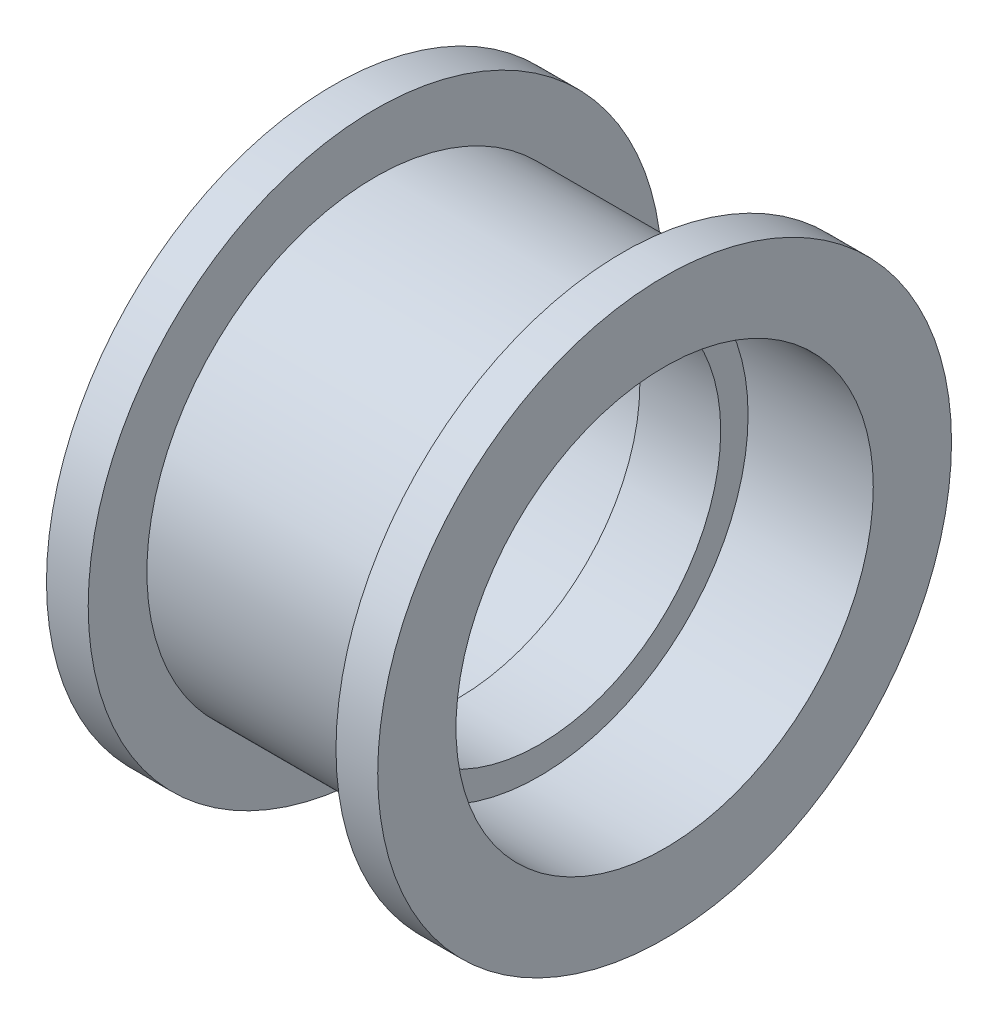
ISO-10303-21;
HEADER;
FILE_DESCRIPTION(('STEP AP214'),'2;1');
FILE_NAME('part.step','',(''),(''),'','','');
FILE_SCHEMA(('AUTOMOTIVE_DESIGN { 1 0 10303 214 1 1 1 1 }'));
ENDSEC;
DATA;
#1=APPLICATION_CONTEXT('core data for automotive mechanical design processes');
#2=APPLICATION_PROTOCOL_DEFINITION('international standard','automotive_design',2000,#1);
#3=PRODUCT_CONTEXT('',#1,'mechanical');
#4=PRODUCT('Part','Part','',(#3));
#5=PRODUCT_RELATED_PRODUCT_CATEGORY('part','',(#4));
#6=PRODUCT_DEFINITION_FORMATION('','',#4);
#7=PRODUCT_DEFINITION_CONTEXT('part definition',#1,'design');
#8=PRODUCT_DEFINITION('design','',#6,#7);
#9=PRODUCT_DEFINITION_SHAPE('','',#8);
#10=(LENGTH_UNIT() NAMED_UNIT(*) SI_UNIT(.MILLI.,.METRE.));
#11=(NAMED_UNIT(*) PLANE_ANGLE_UNIT() SI_UNIT($,.RADIAN.));
#12=(NAMED_UNIT(*) SI_UNIT($,.STERADIAN.) SOLID_ANGLE_UNIT());
#13=UNCERTAINTY_MEASURE_WITH_UNIT(LENGTH_MEASURE(1.E-05),#10,'distance_accuracy_value','');
#14=(GEOMETRIC_REPRESENTATION_CONTEXT(3) GLOBAL_UNCERTAINTY_ASSIGNED_CONTEXT((#13)) GLOBAL_UNIT_ASSIGNED_CONTEXT((#10,
#11,#12)) REPRESENTATION_CONTEXT('',''));
#15=CARTESIAN_POINT('',(0.,0.,0.));
#16=DIRECTION('',(0.,0.,1.));
#17=DIRECTION('',(1.,0.,0.));
#18=AXIS2_PLACEMENT_3D('',#15,#16,#17);
#19=CARTESIAN_POINT('',(-1.55,6.95,0.));
#20=DIRECTION('',(-1.,0.,0.));
#21=DIRECTION('',(0.,0.,1.));
#22=AXIS2_PLACEMENT_3D('',#19,#20,#21);
#23=PLANE('',#22);
#24=CARTESIAN_POINT('',(-1.55,0.,0.));
#25=DIRECTION('',(1.,0.,0.));
#26=DIRECTION('',(0.,0.,-1.));
#27=AXIS2_PLACEMENT_3D('',#24,#25,#26);
#28=CIRCLE('',#27,6.95);
#29=CARTESIAN_POINT('',(-1.55,0.,-6.95));
#30=VERTEX_POINT('',#29);
#31=EDGE_CURVE('E10',#30,#30,#28,.T.);
#32=ORIENTED_EDGE('',*,*,#31,.T.);
#33=EDGE_LOOP('',(#32));
#34=FACE_BOUND('',#33,.T.);
#35=CARTESIAN_POINT('',(-1.55,0.,0.));
#36=DIRECTION('',(1.,0.,0.));
#37=DIRECTION('',(0.,0.,-1.));
#38=AXIS2_PLACEMENT_3D('',#35,#36,#37);
#39=CIRCLE('',#38,8.);
#40=CARTESIAN_POINT('',(-1.55,0.,-8.));
#41=VERTEX_POINT('',#40);
#42=EDGE_CURVE('E70',#41,#41,#39,.T.);
#43=ORIENTED_EDGE('',*,*,#42,.F.);
#44=EDGE_LOOP('',(#43));
#45=FACE_BOUND('',#44,.T.);
#46=ADVANCED_FACE('F30',(#34,#45),#23,.T.);
#47=CARTESIAN_POINT('',(0.,0.,0.));
#48=DIRECTION('',(1.,0.,0.));
#49=DIRECTION('',(0.,0.,-1.));
#50=AXIS2_PLACEMENT_3D('',#47,#48,#49);
#51=CYLINDRICAL_SURFACE('',#50,6.95);
#52=CARTESIAN_POINT('',(1.55,0.,0.));
#53=DIRECTION('',(1.,0.,0.));
#54=DIRECTION('',(0.,0.,-1.));
#55=AXIS2_PLACEMENT_3D('',#52,#53,#54);
#56=CIRCLE('',#55,6.95);
#57=CARTESIAN_POINT('',(1.55,0.,-6.95));
#58=VERTEX_POINT('',#57);
#59=EDGE_CURVE('E36',#58,#58,#56,.T.);
#60=ORIENTED_EDGE('',*,*,#59,.T.);
#61=EDGE_LOOP('',(#60));
#62=FACE_BOUND('',#61,.T.);
#63=ORIENTED_EDGE('',*,*,#31,.F.);
#64=EDGE_LOOP('',(#63));
#65=FACE_BOUND('',#64,.T.);
#66=ADVANCED_FACE('F78',(#62,#65),#51,.F.);
#67=CARTESIAN_POINT('',(1.55,6.95,0.));
#68=DIRECTION('',(1.,0.,0.));
#69=DIRECTION('',(0.,0.,-1.));
#70=AXIS2_PLACEMENT_3D('',#67,#68,#69);
#71=PLANE('',#70);
#72=CARTESIAN_POINT('',(1.55,0.,0.));
#73=DIRECTION('',(1.,0.,0.));
#74=DIRECTION('',(0.,0.,-1.));
#75=AXIS2_PLACEMENT_3D('',#72,#73,#74);
#76=CIRCLE('',#75,8.);
#77=CARTESIAN_POINT('',(1.55,0.,-8.));
#78=VERTEX_POINT('',#77);
#79=EDGE_CURVE('E40',#78,#78,#76,.T.);
#80=ORIENTED_EDGE('',*,*,#79,.T.);
#81=EDGE_LOOP('',(#80));
#82=FACE_BOUND('',#81,.T.);
#83=ORIENTED_EDGE('',*,*,#59,.F.);
#84=EDGE_LOOP('',(#83));
#85=FACE_BOUND('',#84,.T.);
#86=ADVANCED_FACE('F82',(#82,#85),#71,.T.);
#87=CARTESIAN_POINT('',(0.,0.,0.));
#88=DIRECTION('',(1.,0.,0.));
#89=DIRECTION('',(0.,0.,-1.));
#90=AXIS2_PLACEMENT_3D('',#87,#88,#89);
#91=CYLINDRICAL_SURFACE('',#90,8.);
#92=CARTESIAN_POINT('',(6.35,0.,0.));
#93=DIRECTION('',(1.,0.,0.));
#94=DIRECTION('',(0.,0.,-1.));
#95=AXIS2_PLACEMENT_3D('',#92,#93,#94);
#96=CIRCLE('',#95,8.);
#97=CARTESIAN_POINT('',(6.35,0.,-8.));
#98=VERTEX_POINT('',#97);
#99=EDGE_CURVE('E44',#98,#98,#96,.T.);
#100=ORIENTED_EDGE('',*,*,#99,.T.);
#101=EDGE_LOOP('',(#100));
#102=FACE_BOUND('',#101,.T.);
#103=ORIENTED_EDGE('',*,*,#79,.F.);
#104=EDGE_LOOP('',(#103));
#105=FACE_BOUND('',#104,.T.);
#106=ADVANCED_FACE('F86',(#102,#105),#91,.F.);
#107=CARTESIAN_POINT('',(6.35,8.,0.));
#108=DIRECTION('',(1.,0.,0.));
#109=DIRECTION('',(0.,0.,-1.));
#110=AXIS2_PLACEMENT_3D('',#107,#108,#109);
#111=PLANE('',#110);
#112=CARTESIAN_POINT('',(6.35,0.,0.));
#113=DIRECTION('',(1.,0.,0.));
#114=DIRECTION('',(0.,0.,-1.));
#115=AXIS2_PLACEMENT_3D('',#112,#113,#114);
#116=CIRCLE('',#115,11.);
#117=CARTESIAN_POINT('',(6.35,0.,-11.));
#118=VERTEX_POINT('',#117);
#119=EDGE_CURVE('E49',#118,#118,#116,.T.);
#120=ORIENTED_EDGE('',*,*,#119,.T.);
#121=EDGE_LOOP('',(#120));
#122=FACE_BOUND('',#121,.T.);
#123=ORIENTED_EDGE('',*,*,#99,.F.);
#124=EDGE_LOOP('',(#123));
#125=FACE_BOUND('',#124,.T.);
#126=ADVANCED_FACE('F93',(#122,#125),#111,.T.);
#127=CARTESIAN_POINT('',(0.,0.,0.));
#128=DIRECTION('',(1.,0.,0.));
#129=DIRECTION('',(0.,0.,-1.));
#130=AXIS2_PLACEMENT_3D('',#127,#128,#129);
#131=CYLINDRICAL_SURFACE('',#130,11.);
#132=CARTESIAN_POINT('',(4.75,0.,0.));
#133=DIRECTION('',(1.,0.,0.));
#134=DIRECTION('',(0.,0.,-1.));
#135=AXIS2_PLACEMENT_3D('',#132,#133,#134);
#136=CIRCLE('',#135,11.);
#137=CARTESIAN_POINT('',(4.75,0.,-11.));
#138=VERTEX_POINT('',#137);
#139=EDGE_CURVE('E52',#138,#138,#136,.T.);
#140=ORIENTED_EDGE('',*,*,#139,.T.);
#141=EDGE_LOOP('',(#140));
#142=FACE_BOUND('',#141,.T.);
#143=ORIENTED_EDGE('',*,*,#119,.F.);
#144=EDGE_LOOP('',(#143));
#145=FACE_BOUND('',#144,.T.);
#146=ADVANCED_FACE('F97',(#142,#145),#131,.T.);
#147=CARTESIAN_POINT('',(4.75,11.,0.));
#148=DIRECTION('',(-1.,0.,0.));
#149=DIRECTION('',(0.,0.,1.));
#150=AXIS2_PLACEMENT_3D('',#147,#148,#149);
#151=PLANE('',#150);
#152=CARTESIAN_POINT('',(4.75,0.,0.));
#153=DIRECTION('',(1.,0.,0.));
#154=DIRECTION('',(0.,0.,-1.));
#155=AXIS2_PLACEMENT_3D('',#152,#153,#154);
#156=CIRCLE('',#155,8.75);
#157=CARTESIAN_POINT('',(4.75,0.,-8.75));
#158=VERTEX_POINT('',#157);
#159=EDGE_CURVE('E55',#158,#158,#156,.T.);
#160=ORIENTED_EDGE('',*,*,#159,.T.);
#161=EDGE_LOOP('',(#160));
#162=FACE_BOUND('',#161,.T.);
#163=ORIENTED_EDGE('',*,*,#139,.F.);
#164=EDGE_LOOP('',(#163));
#165=FACE_BOUND('',#164,.T.);
#166=ADVANCED_FACE('F101',(#162,#165),#151,.T.);
#167=CARTESIAN_POINT('',(0.,0.,0.));
#168=DIRECTION('',(1.,0.,0.));
#169=DIRECTION('',(0.,0.,-1.));
#170=AXIS2_PLACEMENT_3D('',#167,#168,#169);
#171=CYLINDRICAL_SURFACE('',#170,8.75);
#172=CARTESIAN_POINT('',(-4.75,0.,0.));
#173=DIRECTION('',(1.,0.,0.));
#174=DIRECTION('',(0.,0.,-1.));
#175=AXIS2_PLACEMENT_3D('',#172,#173,#174);
#176=CIRCLE('',#175,8.75);
#177=CARTESIAN_POINT('',(-4.75,0.,-8.75));
#178=VERTEX_POINT('',#177);
#179=EDGE_CURVE('E58',#178,#178,#176,.T.);
#180=ORIENTED_EDGE('',*,*,#179,.T.);
#181=EDGE_LOOP('',(#180));
#182=FACE_BOUND('',#181,.T.);
#183=ORIENTED_EDGE('',*,*,#159,.F.);
#184=EDGE_LOOP('',(#183));
#185=FACE_BOUND('',#184,.T.);
#186=ADVANCED_FACE('F105',(#182,#185),#171,.T.);
#187=CARTESIAN_POINT('',(-4.75,11.,0.));
#188=DIRECTION('',(1.,0.,0.));
#189=DIRECTION('',(0.,0.,-1.));
#190=AXIS2_PLACEMENT_3D('',#187,#188,#189);
#191=PLANE('',#190);
#192=CARTESIAN_POINT('',(-4.75,0.,0.));
#193=DIRECTION('',(1.,0.,0.));
#194=DIRECTION('',(0.,0.,-1.));
#195=AXIS2_PLACEMENT_3D('',#192,#193,#194);
#196=CIRCLE('',#195,11.);
#197=CARTESIAN_POINT('',(-4.75,0.,-11.));
#198=VERTEX_POINT('',#197);
#199=EDGE_CURVE('E61',#198,#198,#196,.T.);
#200=ORIENTED_EDGE('',*,*,#199,.T.);
#201=EDGE_LOOP('',(#200));
#202=FACE_BOUND('',#201,.T.);
#203=ORIENTED_EDGE('',*,*,#179,.F.);
#204=EDGE_LOOP('',(#203));
#205=FACE_BOUND('',#204,.T.);
#206=ADVANCED_FACE('F109',(#202,#205),#191,.T.);
#207=CARTESIAN_POINT('',(0.,0.,0.));
#208=DIRECTION('',(1.,0.,0.));
#209=DIRECTION('',(0.,0.,-1.));
#210=AXIS2_PLACEMENT_3D('',#207,#208,#209);
#211=CYLINDRICAL_SURFACE('',#210,11.);
#212=CARTESIAN_POINT('',(-6.35,0.,0.));
#213=DIRECTION('',(1.,0.,0.));
#214=DIRECTION('',(0.,0.,-1.));
#215=AXIS2_PLACEMENT_3D('',#212,#213,#214);
#216=CIRCLE('',#215,11.);
#217=CARTESIAN_POINT('',(-6.35,0.,-11.));
#218=VERTEX_POINT('',#217);
#219=EDGE_CURVE('E64',#218,#218,#216,.T.);
#220=ORIENTED_EDGE('',*,*,#219,.T.);
#221=EDGE_LOOP('',(#220));
#222=FACE_BOUND('',#221,.T.);
#223=ORIENTED_EDGE('',*,*,#199,.F.);
#224=EDGE_LOOP('',(#223));
#225=FACE_BOUND('',#224,.T.);
#226=ADVANCED_FACE('F113',(#222,#225),#211,.T.);
#227=CARTESIAN_POINT('',(-6.35,8.,0.));
#228=DIRECTION('',(-1.,0.,0.));
#229=DIRECTION('',(0.,0.,1.));
#230=AXIS2_PLACEMENT_3D('',#227,#228,#229);
#231=PLANE('',#230);
#232=CARTESIAN_POINT('',(-6.35,0.,0.));
#233=DIRECTION('',(1.,0.,0.));
#234=DIRECTION('',(0.,0.,-1.));
#235=AXIS2_PLACEMENT_3D('',#232,#233,#234);
#236=CIRCLE('',#235,8.);
#237=CARTESIAN_POINT('',(-6.35,0.,-8.));
#238=VERTEX_POINT('',#237);
#239=EDGE_CURVE('E67',#238,#238,#236,.T.);
#240=ORIENTED_EDGE('',*,*,#239,.T.);
#241=EDGE_LOOP('',(#240));
#242=FACE_BOUND('',#241,.T.);
#243=ORIENTED_EDGE('',*,*,#219,.F.);
#244=EDGE_LOOP('',(#243));
#245=FACE_BOUND('',#244,.T.);
#246=ADVANCED_FACE('F117',(#242,#245),#231,.T.);
#247=CARTESIAN_POINT('',(0.,0.,0.));
#248=DIRECTION('',(1.,0.,0.));
#249=DIRECTION('',(0.,0.,-1.));
#250=AXIS2_PLACEMENT_3D('',#247,#248,#249);
#251=CYLINDRICAL_SURFACE('',#250,8.);
#252=ORIENTED_EDGE('',*,*,#42,.T.);
#253=EDGE_LOOP('',(#252));
#254=FACE_BOUND('',#253,.T.);
#255=ORIENTED_EDGE('',*,*,#239,.F.);
#256=EDGE_LOOP('',(#255));
#257=FACE_BOUND('',#256,.T.);
#258=ADVANCED_FACE('F74',(#254,#257),#251,.F.);
#259=CLOSED_SHELL('',(#46,#66,#86,#106,#126,#146,#166,#186,#206,#226,#246,#258));
#260=MANIFOLD_SOLID_BREP('B2',#259);
#261=ADVANCED_BREP_SHAPE_REPRESENTATION('',(#18,#260),#14);
#262=SHAPE_DEFINITION_REPRESENTATION(#9,#261);
ENDSEC;
END-ISO-10303-21;
